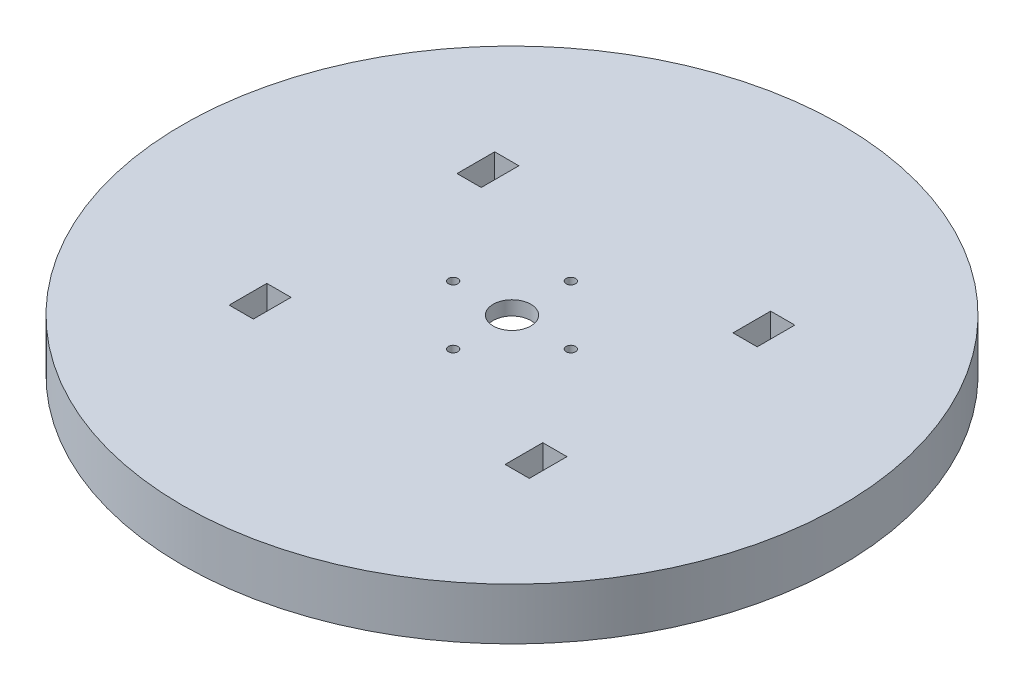
ISO-10303-21;
HEADER;
FILE_DESCRIPTION(('STEP AP214'),'2;1');
FILE_NAME('part.step','',(''),(''),'','','');
FILE_SCHEMA(('AUTOMOTIVE_DESIGN { 1 0 10303 214 1 1 1 1 }'));
ENDSEC;
DATA;
#1=APPLICATION_CONTEXT('core data for automotive mechanical design processes');
#2=APPLICATION_PROTOCOL_DEFINITION('international standard','automotive_design',2000,#1);
#3=PRODUCT_CONTEXT('',#1,'mechanical');
#4=PRODUCT('Part','Part','',(#3));
#5=PRODUCT_RELATED_PRODUCT_CATEGORY('part','',(#4));
#6=PRODUCT_DEFINITION_FORMATION('','',#4);
#7=PRODUCT_DEFINITION_CONTEXT('part definition',#1,'design');
#8=PRODUCT_DEFINITION('design','',#6,#7);
#9=PRODUCT_DEFINITION_SHAPE('','',#8);
#10=(LENGTH_UNIT() NAMED_UNIT(*) SI_UNIT(.MILLI.,.METRE.));
#11=(NAMED_UNIT(*) PLANE_ANGLE_UNIT() SI_UNIT($,.RADIAN.));
#12=(NAMED_UNIT(*) SI_UNIT($,.STERADIAN.) SOLID_ANGLE_UNIT());
#13=UNCERTAINTY_MEASURE_WITH_UNIT(LENGTH_MEASURE(1.E-05),#10,'distance_accuracy_value','');
#14=(GEOMETRIC_REPRESENTATION_CONTEXT(3) GLOBAL_UNCERTAINTY_ASSIGNED_CONTEXT((#13)) GLOBAL_UNIT_ASSIGNED_CONTEXT((#10,
#11,#12)) REPRESENTATION_CONTEXT('',''));
#15=CARTESIAN_POINT('',(0.,0.,0.));
#16=DIRECTION('',(0.,0.,1.));
#17=DIRECTION('',(1.,0.,0.));
#18=AXIS2_PLACEMENT_3D('',#15,#16,#17);
#19=CARTESIAN_POINT('',(12.5,-3.,0.));
#20=DIRECTION('',(0.,1.,0.));
#21=DIRECTION('',(0.,0.,1.));
#22=AXIS2_PLACEMENT_3D('',#19,#20,#21);
#23=CYLINDRICAL_SURFACE('',#22,1.);
#24=CARTESIAN_POINT('',(12.5,-3.,0.));
#25=DIRECTION('',(0.,1.,0.));
#26=DIRECTION('',(0.,0.,1.));
#27=AXIS2_PLACEMENT_3D('',#24,#25,#26);
#28=CIRCLE('',#27,1.);
#29=CARTESIAN_POINT('',(12.5,-3.,1.));
#30=VERTEX_POINT('',#29);
#31=EDGE_CURVE('E47',#30,#30,#28,.T.);
#32=ORIENTED_EDGE('',*,*,#31,.F.);
#33=EDGE_LOOP('',(#32));
#34=FACE_BOUND('',#33,.T.);
#35=CARTESIAN_POINT('',(12.5,0.,0.));
#36=DIRECTION('',(0.,1.,0.));
#37=DIRECTION('',(0.,0.,1.));
#38=AXIS2_PLACEMENT_3D('',#35,#36,#37);
#39=CIRCLE('',#38,1.);
#40=CARTESIAN_POINT('',(12.5,0.,1.));
#41=VERTEX_POINT('',#40);
#42=EDGE_CURVE('E283',#41,#41,#39,.T.);
#43=ORIENTED_EDGE('',*,*,#42,.T.);
#44=EDGE_LOOP('',(#43));
#45=FACE_BOUND('',#44,.T.);
#46=ADVANCED_FACE('F37',(#34,#45),#23,.F.);
#47=CARTESIAN_POINT('',(0.,-3.,-12.5));
#48=DIRECTION('',(0.,1.,0.));
#49=DIRECTION('',(0.,0.,1.));
#50=AXIS2_PLACEMENT_3D('',#47,#48,#49);
#51=CYLINDRICAL_SURFACE('',#50,1.);
#52=CARTESIAN_POINT('',(0.,-3.,-12.5));
#53=DIRECTION('',(0.,1.,0.));
#54=DIRECTION('',(0.,0.,1.));
#55=AXIS2_PLACEMENT_3D('',#52,#53,#54);
#56=CIRCLE('',#55,1.);
#57=CARTESIAN_POINT('',(0.,-3.,-11.5));
#58=VERTEX_POINT('',#57);
#59=EDGE_CURVE('E268',#58,#58,#56,.T.);
#60=ORIENTED_EDGE('',*,*,#59,.F.);
#61=EDGE_LOOP('',(#60));
#62=FACE_BOUND('',#61,.T.);
#63=CARTESIAN_POINT('',(0.,0.,-12.5));
#64=DIRECTION('',(0.,1.,0.));
#65=DIRECTION('',(0.,0.,1.));
#66=AXIS2_PLACEMENT_3D('',#63,#64,#65);
#67=CIRCLE('',#66,1.);
#68=CARTESIAN_POINT('',(0.,0.,-11.5));
#69=VERTEX_POINT('',#68);
#70=EDGE_CURVE('E281',#69,#69,#67,.T.);
#71=ORIENTED_EDGE('',*,*,#70,.T.);
#72=EDGE_LOOP('',(#71));
#73=FACE_BOUND('',#72,.T.);
#74=ADVANCED_FACE('F309',(#62,#73),#51,.F.);
#75=CARTESIAN_POINT('',(0.,-3.,12.5));
#76=DIRECTION('',(0.,1.,0.));
#77=DIRECTION('',(0.,0.,1.));
#78=AXIS2_PLACEMENT_3D('',#75,#76,#77);
#79=CYLINDRICAL_SURFACE('',#78,1.);
#80=CARTESIAN_POINT('',(0.,-3.,12.5));
#81=DIRECTION('',(0.,1.,0.));
#82=DIRECTION('',(0.,0.,1.));
#83=AXIS2_PLACEMENT_3D('',#80,#81,#82);
#84=CIRCLE('',#83,1.);
#85=CARTESIAN_POINT('',(0.,-3.,13.5));
#86=VERTEX_POINT('',#85);
#87=EDGE_CURVE('E265',#86,#86,#84,.F.);
#88=ORIENTED_EDGE('',*,*,#87,.T.);
#89=EDGE_LOOP('',(#88));
#90=FACE_BOUND('',#89,.T.);
#91=CARTESIAN_POINT('',(0.,0.,12.5));
#92=DIRECTION('',(0.,1.,0.));
#93=DIRECTION('',(0.,0.,1.));
#94=AXIS2_PLACEMENT_3D('',#91,#92,#93);
#95=CIRCLE('',#94,1.);
#96=CARTESIAN_POINT('',(0.,0.,13.5));
#97=VERTEX_POINT('',#96);
#98=EDGE_CURVE('E278',#97,#97,#95,.F.);
#99=ORIENTED_EDGE('',*,*,#98,.F.);
#100=EDGE_LOOP('',(#99));
#101=FACE_BOUND('',#100,.T.);
#102=ADVANCED_FACE('F304',(#90,#101),#79,.F.);
#103=CARTESIAN_POINT('',(0.,-3.,0.));
#104=DIRECTION('',(0.,1.,0.));
#105=DIRECTION('',(0.,0.,1.));
#106=AXIS2_PLACEMENT_3D('',#103,#104,#105);
#107=CYLINDRICAL_SURFACE('',#106,4.);
#108=CARTESIAN_POINT('',(0.,-3.,0.));
#109=DIRECTION('',(0.,1.,0.));
#110=DIRECTION('',(0.,0.,1.));
#111=AXIS2_PLACEMENT_3D('',#108,#109,#110);
#112=CIRCLE('',#111,4.);
#113=CARTESIAN_POINT('',(0.,-3.,4.));
#114=VERTEX_POINT('',#113);
#115=EDGE_CURVE('E262',#114,#114,#112,.T.);
#116=ORIENTED_EDGE('',*,*,#115,.F.);
#117=EDGE_LOOP('',(#116));
#118=FACE_BOUND('',#117,.T.);
#119=CARTESIAN_POINT('',(0.,0.,0.));
#120=DIRECTION('',(0.,1.,0.));
#121=DIRECTION('',(0.,0.,1.));
#122=AXIS2_PLACEMENT_3D('',#119,#120,#121);
#123=CIRCLE('',#122,4.);
#124=CARTESIAN_POINT('',(0.,0.,4.));
#125=VERTEX_POINT('',#124);
#126=EDGE_CURVE('E233',#125,#125,#123,.T.);
#127=ORIENTED_EDGE('',*,*,#126,.T.);
#128=EDGE_LOOP('',(#127));
#129=FACE_BOUND('',#128,.T.);
#130=ADVANCED_FACE('F39',(#118,#129),#107,.F.);
#131=CARTESIAN_POINT('',(-12.5,-3.,0.));
#132=DIRECTION('',(0.,1.,0.));
#133=DIRECTION('',(0.,0.,1.));
#134=AXIS2_PLACEMENT_3D('',#131,#132,#133);
#135=CYLINDRICAL_SURFACE('',#134,1.);
#136=CARTESIAN_POINT('',(-12.5,-3.,0.));
#137=DIRECTION('',(0.,1.,0.));
#138=DIRECTION('',(0.,0.,1.));
#139=AXIS2_PLACEMENT_3D('',#136,#137,#138);
#140=CIRCLE('',#139,1.);
#141=CARTESIAN_POINT('',(-12.5,-3.,1.));
#142=VERTEX_POINT('',#141);
#143=EDGE_CURVE('E11',#142,#142,#140,.F.);
#144=ORIENTED_EDGE('',*,*,#143,.T.);
#145=EDGE_LOOP('',(#144));
#146=FACE_BOUND('',#145,.T.);
#147=CARTESIAN_POINT('',(-12.5,0.,0.));
#148=DIRECTION('',(0.,1.,0.));
#149=DIRECTION('',(0.,0.,1.));
#150=AXIS2_PLACEMENT_3D('',#147,#148,#149);
#151=CIRCLE('',#150,1.);
#152=CARTESIAN_POINT('',(-12.5,0.,1.));
#153=VERTEX_POINT('',#152);
#154=EDGE_CURVE('E41',#153,#153,#151,.F.);
#155=ORIENTED_EDGE('',*,*,#154,.F.);
#156=EDGE_LOOP('',(#155));
#157=FACE_BOUND('',#156,.T.);
#158=ADVANCED_FACE('F293',(#146,#157),#135,.F.);
#159=CARTESIAN_POINT('',(0.,-3.,0.));
#160=DIRECTION('',(0.,1.,0.));
#161=DIRECTION('',(0.,0.,1.));
#162=AXIS2_PLACEMENT_3D('',#159,#160,#161);
#163=PLANE('',#162);
#164=ORIENTED_EDGE('',*,*,#115,.T.);
#165=EDGE_LOOP('',(#164));
#166=FACE_BOUND('',#165,.T.);
#167=ORIENTED_EDGE('',*,*,#87,.F.);
#168=EDGE_LOOP('',(#167));
#169=FACE_BOUND('',#168,.T.);
#170=ORIENTED_EDGE('',*,*,#59,.T.);
#171=EDGE_LOOP('',(#170));
#172=FACE_BOUND('',#171,.T.);
#173=CARTESIAN_POINT('',(0.,-3.,0.));
#174=DIRECTION('',(0.,1.,0.));
#175=DIRECTION('',(0.,0.,1.));
#176=AXIS2_PLACEMENT_3D('',#173,#174,#175);
#177=CIRCLE('',#176,22.5);
#178=CARTESIAN_POINT('',(0.,-3.,22.5));
#179=VERTEX_POINT('',#178);
#180=EDGE_CURVE('E271',#179,#179,#177,.T.);
#181=ORIENTED_EDGE('',*,*,#180,.F.);
#182=EDGE_LOOP('',(#181));
#183=FACE_BOUND('',#182,.T.);
#184=ORIENTED_EDGE('',*,*,#31,.T.);
#185=EDGE_LOOP('',(#184));
#186=FACE_BOUND('',#185,.T.);
#187=ORIENTED_EDGE('',*,*,#143,.F.);
#188=EDGE_LOOP('',(#187));
#189=FACE_BOUND('',#188,.T.);
#190=ADVANCED_FACE('F295',(#166,#169,#172,#183,#186,#189),#163,.F.);
#191=CARTESIAN_POINT('',(0.,0.,0.));
#192=DIRECTION('',(0.,1.,0.));
#193=DIRECTION('',(0.,0.,1.));
#194=AXIS2_PLACEMENT_3D('',#191,#192,#193);
#195=PLANE('',#194);
#196=ORIENTED_EDGE('',*,*,#126,.F.);
#197=EDGE_LOOP('',(#196));
#198=FACE_BOUND('',#197,.T.);
#199=ORIENTED_EDGE('',*,*,#98,.T.);
#200=EDGE_LOOP('',(#199));
#201=FACE_BOUND('',#200,.T.);
#202=ORIENTED_EDGE('',*,*,#70,.F.);
#203=EDGE_LOOP('',(#202));
#204=FACE_BOUND('',#203,.T.);
#205=ORIENTED_EDGE('',*,*,#42,.F.);
#206=EDGE_LOOP('',(#205));
#207=FACE_BOUND('',#206,.T.);
#208=ORIENTED_EDGE('',*,*,#154,.T.);
#209=EDGE_LOOP('',(#208));
#210=FACE_BOUND('',#209,.T.);
#211=DIRECTION('',(1.,0.,0.));
#212=VECTOR('',#211,1.);
#213=CARTESIAN_POINT('',(0.,0.,-20.2));
#214=LINE('',#213,#212);
#215=CARTESIAN_POINT('',(26.7380641973512,0.,-20.2));
#216=VERTEX_POINT('',#215);
#217=CARTESIAN_POINT('',(31.8763716720232,0.,-20.2));
#218=VERTEX_POINT('',#217);
#219=EDGE_CURVE('E186',#216,#218,#214,.T.);
#220=ORIENTED_EDGE('',*,*,#219,.F.);
#221=DIRECTION('',(0.,0.,-1.));
#222=VECTOR('',#221,1.);
#223=CARTESIAN_POINT('',(26.7380641973512,0.,0.));
#224=LINE('',#223,#222);
#225=CARTESIAN_POINT('',(26.7380641973512,0.,-28.2));
#226=VERTEX_POINT('',#225);
#227=EDGE_CURVE('E189',#216,#226,#224,.T.);
#228=ORIENTED_EDGE('',*,*,#227,.T.);
#229=DIRECTION('',(1.,0.,0.));
#230=VECTOR('',#229,1.);
#231=CARTESIAN_POINT('',(0.,0.,-28.2));
#232=LINE('',#231,#230);
#233=CARTESIAN_POINT('',(31.8763716720232,0.,-28.2));
#234=VERTEX_POINT('',#233);
#235=EDGE_CURVE('E193',#226,#234,#232,.T.);
#236=ORIENTED_EDGE('',*,*,#235,.T.);
#237=DIRECTION('',(0.,0.,-1.));
#238=VECTOR('',#237,1.);
#239=CARTESIAN_POINT('',(31.8763716720232,0.,0.));
#240=LINE('',#239,#238);
#241=EDGE_CURVE('E196',#218,#234,#240,.T.);
#242=ORIENTED_EDGE('',*,*,#241,.F.);
#243=EDGE_LOOP('',(#220,#228,#236,#242));
#244=FACE_BOUND('',#243,.T.);
#245=DIRECTION('',(-1.,0.,0.));
#246=VECTOR('',#245,1.);
#247=CARTESIAN_POINT('',(0.,0.,20.2));
#248=LINE('',#247,#246);
#249=CARTESIAN_POINT('',(-26.7380641973512,0.,20.2));
#250=VERTEX_POINT('',#249);
#251=CARTESIAN_POINT('',(-31.8763716720232,0.,20.2));
#252=VERTEX_POINT('',#251);
#253=EDGE_CURVE('E199',#250,#252,#248,.T.);
#254=ORIENTED_EDGE('',*,*,#253,.F.);
#255=DIRECTION('',(0.,0.,1.));
#256=VECTOR('',#255,1.);
#257=CARTESIAN_POINT('',(-26.7380641973512,0.,0.));
#258=LINE('',#257,#256);
#259=CARTESIAN_POINT('',(-26.7380641973512,0.,28.2));
#260=VERTEX_POINT('',#259);
#261=EDGE_CURVE('E202',#250,#260,#258,.T.);
#262=ORIENTED_EDGE('',*,*,#261,.T.);
#263=DIRECTION('',(-1.,0.,0.));
#264=VECTOR('',#263,1.);
#265=CARTESIAN_POINT('',(0.,0.,28.2));
#266=LINE('',#265,#264);
#267=CARTESIAN_POINT('',(-31.8763716720232,0.,28.2));
#268=VERTEX_POINT('',#267);
#269=EDGE_CURVE('E205',#260,#268,#266,.T.);
#270=ORIENTED_EDGE('',*,*,#269,.T.);
#271=DIRECTION('',(0.,0.,1.));
#272=VECTOR('',#271,1.);
#273=CARTESIAN_POINT('',(-31.8763716720232,0.,0.));
#274=LINE('',#273,#272);
#275=EDGE_CURVE('E208',#252,#268,#274,.T.);
#276=ORIENTED_EDGE('',*,*,#275,.F.);
#277=EDGE_LOOP('',(#254,#262,#270,#276));
#278=FACE_BOUND('',#277,.T.);
#279=DIRECTION('',(-1.,0.,0.));
#280=VECTOR('',#279,1.);
#281=CARTESIAN_POINT('',(0.,0.,-20.2));
#282=LINE('',#281,#280);
#283=CARTESIAN_POINT('',(-26.7380641973512,0.,-20.2));
#284=VERTEX_POINT('',#283);
#285=CARTESIAN_POINT('',(-31.8763716720232,0.,-20.2));
#286=VERTEX_POINT('',#285);
#287=EDGE_CURVE('E211',#284,#286,#282,.T.);
#288=ORIENTED_EDGE('',*,*,#287,.T.);
#289=DIRECTION('',(0.,0.,-1.));
#290=VECTOR('',#289,1.);
#291=CARTESIAN_POINT('',(-31.8763716720232,0.,0.));
#292=LINE('',#291,#290);
#293=CARTESIAN_POINT('',(-31.8763716720232,0.,-28.2));
#294=VERTEX_POINT('',#293);
#295=EDGE_CURVE('E214',#286,#294,#292,.T.);
#296=ORIENTED_EDGE('',*,*,#295,.T.);
#297=DIRECTION('',(-1.,0.,0.));
#298=VECTOR('',#297,1.);
#299=CARTESIAN_POINT('',(0.,0.,-28.2));
#300=LINE('',#299,#298);
#301=CARTESIAN_POINT('',(-26.7380641973512,0.,-28.2));
#302=VERTEX_POINT('',#301);
#303=EDGE_CURVE('E217',#302,#294,#300,.T.);
#304=ORIENTED_EDGE('',*,*,#303,.F.);
#305=DIRECTION('',(0.,0.,-1.));
#306=VECTOR('',#305,1.);
#307=CARTESIAN_POINT('',(-26.7380641973512,0.,0.));
#308=LINE('',#307,#306);
#309=EDGE_CURVE('E220',#284,#302,#308,.T.);
#310=ORIENTED_EDGE('',*,*,#309,.F.);
#311=EDGE_LOOP('',(#288,#296,#304,#310));
#312=FACE_BOUND('',#311,.T.);
#313=DIRECTION('',(1.,0.,0.));
#314=VECTOR('',#313,1.);
#315=CARTESIAN_POINT('',(0.,0.,28.2));
#316=LINE('',#315,#314);
#317=CARTESIAN_POINT('',(26.7380641973512,0.,28.2));
#318=VERTEX_POINT('',#317);
#319=CARTESIAN_POINT('',(31.8763716720232,0.,28.2));
#320=VERTEX_POINT('',#319);
#321=EDGE_CURVE('E223',#318,#320,#316,.T.);
#322=ORIENTED_EDGE('',*,*,#321,.F.);
#323=DIRECTION('',(0.,0.,1.));
#324=VECTOR('',#323,1.);
#325=CARTESIAN_POINT('',(26.7380641973512,0.,0.));
#326=LINE('',#325,#324);
#327=CARTESIAN_POINT('',(26.7380641973512,0.,20.2));
#328=VERTEX_POINT('',#327);
#329=EDGE_CURVE('E225',#328,#318,#326,.T.);
#330=ORIENTED_EDGE('',*,*,#329,.F.);
#331=DIRECTION('',(1.,0.,0.));
#332=VECTOR('',#331,1.);
#333=CARTESIAN_POINT('',(0.,0.,20.2));
#334=LINE('',#333,#332);
#335=CARTESIAN_POINT('',(31.8763716720232,0.,20.2));
#336=VERTEX_POINT('',#335);
#337=EDGE_CURVE('E166',#328,#336,#334,.T.);
#338=ORIENTED_EDGE('',*,*,#337,.T.);
#339=DIRECTION('',(0.,0.,1.));
#340=VECTOR('',#339,1.);
#341=CARTESIAN_POINT('',(31.8763716720232,0.,0.));
#342=LINE('',#341,#340);
#343=EDGE_CURVE('E228',#336,#320,#342,.T.);
#344=ORIENTED_EDGE('',*,*,#343,.T.);
#345=EDGE_LOOP('',(#322,#330,#338,#344));
#346=FACE_BOUND('',#345,.T.);
#347=CARTESIAN_POINT('',(0.,0.,0.));
#348=DIRECTION('',(0.,1.,0.));
#349=DIRECTION('',(0.,0.,1.));
#350=AXIS2_PLACEMENT_3D('',#347,#348,#349);
#351=CIRCLE('',#350,70.);
#352=CARTESIAN_POINT('',(0.,0.,70.));
#353=VERTEX_POINT('',#352);
#354=EDGE_CURVE('E420',#353,#353,#351,.T.);
#355=ORIENTED_EDGE('',*,*,#354,.T.);
#356=EDGE_LOOP('',(#355));
#357=FACE_BOUND('',#356,.T.);
#358=ADVANCED_FACE('F290',(#198,#201,#204,#207,#210,#244,#278,#312,#346,#357),#195,.T.);
#359=CARTESIAN_POINT('',(0.,-8.,0.));
#360=DIRECTION('',(0.,1.,0.));
#361=DIRECTION('',(0.,0.,1.));
#362=AXIS2_PLACEMENT_3D('',#359,#360,#361);
#363=CYLINDRICAL_SURFACE('',#362,22.5);
#364=CARTESIAN_POINT('',(0.,-8.,0.));
#365=DIRECTION('',(0.,1.,0.));
#366=DIRECTION('',(0.,0.,1.));
#367=AXIS2_PLACEMENT_3D('',#364,#365,#366);
#368=CIRCLE('',#367,22.5);
#369=CARTESIAN_POINT('',(0.,-8.,22.5));
#370=VERTEX_POINT('',#369);
#371=EDGE_CURVE('E231',#370,#370,#368,.T.);
#372=ORIENTED_EDGE('',*,*,#371,.F.);
#373=EDGE_LOOP('',(#372));
#374=FACE_BOUND('',#373,.T.);
#375=ORIENTED_EDGE('',*,*,#180,.T.);
#376=EDGE_LOOP('',(#375));
#377=FACE_BOUND('',#376,.T.);
#378=ADVANCED_FACE('F327',(#374,#377),#363,.F.);
#379=CARTESIAN_POINT('',(0.,-8.,28.2));
#380=DIRECTION('',(0.,0.,1.));
#381=DIRECTION('',(1.,0.,0.));
#382=AXIS2_PLACEMENT_3D('',#379,#380,#381);
#383=PLANE('',#382);
#384=ORIENTED_EDGE('',*,*,#321,.T.);
#385=DIRECTION('',(0.,1.,0.));
#386=VECTOR('',#385,1.);
#387=CARTESIAN_POINT('',(31.8763716720232,-8.,28.2));
#388=LINE('',#387,#386);
#389=CARTESIAN_POINT('',(31.8763716720232,-8.,28.2));
#390=VERTEX_POINT('',#389);
#391=EDGE_CURVE('E116',#390,#320,#388,.T.);
#392=ORIENTED_EDGE('',*,*,#391,.F.);
#393=DIRECTION('',(1.,0.,0.));
#394=VECTOR('',#393,1.);
#395=CARTESIAN_POINT('',(0.,-8.,28.2));
#396=LINE('',#395,#394);
#397=CARTESIAN_POINT('',(26.7380641973512,-8.,28.2));
#398=VERTEX_POINT('',#397);
#399=EDGE_CURVE('E56',#398,#390,#396,.T.);
#400=ORIENTED_EDGE('',*,*,#399,.F.);
#401=DIRECTION('',(0.,1.,0.));
#402=VECTOR('',#401,1.);
#403=CARTESIAN_POINT('',(26.7380641973512,-8.,28.2));
#404=LINE('',#403,#402);
#405=EDGE_CURVE('E169',#398,#318,#404,.T.);
#406=ORIENTED_EDGE('',*,*,#405,.T.);
#407=EDGE_LOOP('',(#384,#392,#400,#406));
#408=FACE_BOUND('',#407,.T.);
#409=ADVANCED_FACE('F335',(#408),#383,.F.);
#410=CARTESIAN_POINT('',(31.8763716720232,-8.,0.));
#411=DIRECTION('',(-1.,0.,0.));
#412=DIRECTION('',(0.,0.,1.));
#413=AXIS2_PLACEMENT_3D('',#410,#411,#412);
#414=PLANE('',#413);
#415=ORIENTED_EDGE('',*,*,#343,.F.);
#416=DIRECTION('',(0.,1.,0.));
#417=VECTOR('',#416,1.);
#418=CARTESIAN_POINT('',(31.8763716720232,-8.,20.2));
#419=LINE('',#418,#417);
#420=CARTESIAN_POINT('',(31.8763716720232,-8.,20.2));
#421=VERTEX_POINT('',#420);
#422=EDGE_CURVE('E109',#421,#336,#419,.T.);
#423=ORIENTED_EDGE('',*,*,#422,.F.);
#424=DIRECTION('',(0.,0.,1.));
#425=VECTOR('',#424,1.);
#426=CARTESIAN_POINT('',(31.8763716720232,-8.,0.));
#427=LINE('',#426,#425);
#428=EDGE_CURVE('E178',#421,#390,#427,.T.);
#429=ORIENTED_EDGE('',*,*,#428,.T.);
#430=ORIENTED_EDGE('',*,*,#391,.T.);
#431=EDGE_LOOP('',(#415,#423,#429,#430));
#432=FACE_BOUND('',#431,.T.);
#433=ADVANCED_FACE('F389',(#432),#414,.T.);
#434=CARTESIAN_POINT('',(0.,-8.,20.2));
#435=DIRECTION('',(0.,0.,1.));
#436=DIRECTION('',(1.,0.,0.));
#437=AXIS2_PLACEMENT_3D('',#434,#435,#436);
#438=PLANE('',#437);
#439=ORIENTED_EDGE('',*,*,#337,.F.);
#440=DIRECTION('',(0.,1.,0.));
#441=VECTOR('',#440,1.);
#442=CARTESIAN_POINT('',(26.7380641973512,-8.,20.2));
#443=LINE('',#442,#441);
#444=CARTESIAN_POINT('',(26.7380641973512,-8.,20.2));
#445=VERTEX_POINT('',#444);
#446=EDGE_CURVE('E161',#445,#328,#443,.T.);
#447=ORIENTED_EDGE('',*,*,#446,.F.);
#448=DIRECTION('',(1.,0.,0.));
#449=VECTOR('',#448,1.);
#450=CARTESIAN_POINT('',(0.,-8.,20.2));
#451=LINE('',#450,#449);
#452=EDGE_CURVE('E165',#445,#421,#451,.T.);
#453=ORIENTED_EDGE('',*,*,#452,.T.);
#454=ORIENTED_EDGE('',*,*,#422,.T.);
#455=EDGE_LOOP('',(#439,#447,#453,#454));
#456=FACE_BOUND('',#455,.T.);
#457=ADVANCED_FACE('F163',(#456),#438,.T.);
#458=CARTESIAN_POINT('',(0.,-8.,-20.2));
#459=DIRECTION('',(0.,0.,-1.));
#460=DIRECTION('',(-1.,0.,0.));
#461=AXIS2_PLACEMENT_3D('',#458,#459,#460);
#462=PLANE('',#461);
#463=ORIENTED_EDGE('',*,*,#287,.F.);
#464=DIRECTION('',(0.,1.,0.));
#465=VECTOR('',#464,1.);
#466=CARTESIAN_POINT('',(-26.7380641973512,-8.,-20.2));
#467=LINE('',#466,#465);
#468=CARTESIAN_POINT('',(-26.7380641973512,-8.,-20.2));
#469=VERTEX_POINT('',#468);
#470=EDGE_CURVE('E236',#469,#284,#467,.T.);
#471=ORIENTED_EDGE('',*,*,#470,.F.);
#472=DIRECTION('',(-1.,0.,0.));
#473=VECTOR('',#472,1.);
#474=CARTESIAN_POINT('',(0.,-8.,-20.2));
#475=LINE('',#474,#473);
#476=CARTESIAN_POINT('',(-31.8763716720232,-8.,-20.2));
#477=VERTEX_POINT('',#476);
#478=EDGE_CURVE('E448',#469,#477,#475,.T.);
#479=ORIENTED_EDGE('',*,*,#478,.T.);
#480=DIRECTION('',(0.,1.,0.));
#481=VECTOR('',#480,1.);
#482=CARTESIAN_POINT('',(-31.8763716720232,-8.,-20.2));
#483=LINE('',#482,#481);
#484=EDGE_CURVE('E243',#477,#286,#483,.T.);
#485=ORIENTED_EDGE('',*,*,#484,.T.);
#486=EDGE_LOOP('',(#463,#471,#479,#485));
#487=FACE_BOUND('',#486,.T.);
#488=ADVANCED_FACE('F373',(#487),#462,.T.);
#489=CARTESIAN_POINT('',(-26.7380641973512,-8.,0.));
#490=DIRECTION('',(1.,0.,0.));
#491=DIRECTION('',(0.,0.,-1.));
#492=AXIS2_PLACEMENT_3D('',#489,#490,#491);
#493=PLANE('',#492);
#494=ORIENTED_EDGE('',*,*,#309,.T.);
#495=DIRECTION('',(0.,1.,0.));
#496=VECTOR('',#495,1.);
#497=CARTESIAN_POINT('',(-26.7380641973512,-8.,-28.2));
#498=LINE('',#497,#496);
#499=CARTESIAN_POINT('',(-26.7380641973512,-8.,-28.2));
#500=VERTEX_POINT('',#499);
#501=EDGE_CURVE('E238',#500,#302,#498,.T.);
#502=ORIENTED_EDGE('',*,*,#501,.F.);
#503=DIRECTION('',(0.,0.,-1.));
#504=VECTOR('',#503,1.);
#505=CARTESIAN_POINT('',(-26.7380641973512,-8.,0.));
#506=LINE('',#505,#504);
#507=EDGE_CURVE('E456',#469,#500,#506,.T.);
#508=ORIENTED_EDGE('',*,*,#507,.F.);
#509=ORIENTED_EDGE('',*,*,#470,.T.);
#510=EDGE_LOOP('',(#494,#502,#508,#509));
#511=FACE_BOUND('',#510,.T.);
#512=ADVANCED_FACE('F376',(#511),#493,.F.);
#513=CARTESIAN_POINT('',(0.,-8.,-28.2));
#514=DIRECTION('',(0.,0.,-1.));
#515=DIRECTION('',(-1.,0.,0.));
#516=AXIS2_PLACEMENT_3D('',#513,#514,#515);
#517=PLANE('',#516);
#518=ORIENTED_EDGE('',*,*,#303,.T.);
#519=DIRECTION('',(0.,1.,0.));
#520=VECTOR('',#519,1.);
#521=CARTESIAN_POINT('',(-31.8763716720232,-8.,-28.2));
#522=LINE('',#521,#520);
#523=CARTESIAN_POINT('',(-31.8763716720232,-8.,-28.2));
#524=VERTEX_POINT('',#523);
#525=EDGE_CURVE('E241',#524,#294,#522,.T.);
#526=ORIENTED_EDGE('',*,*,#525,.F.);
#527=DIRECTION('',(-1.,0.,0.));
#528=VECTOR('',#527,1.);
#529=CARTESIAN_POINT('',(0.,-8.,-28.2));
#530=LINE('',#529,#528);
#531=EDGE_CURVE('E454',#500,#524,#530,.T.);
#532=ORIENTED_EDGE('',*,*,#531,.F.);
#533=ORIENTED_EDGE('',*,*,#501,.T.);
#534=EDGE_LOOP('',(#518,#526,#532,#533));
#535=FACE_BOUND('',#534,.T.);
#536=ADVANCED_FACE('F361',(#535),#517,.F.);
#537=CARTESIAN_POINT('',(0.,-8.,20.2));
#538=DIRECTION('',(0.,0.,-1.));
#539=DIRECTION('',(-1.,0.,0.));
#540=AXIS2_PLACEMENT_3D('',#537,#538,#539);
#541=PLANE('',#540);
#542=ORIENTED_EDGE('',*,*,#253,.T.);
#543=DIRECTION('',(0.,1.,0.));
#544=VECTOR('',#543,1.);
#545=CARTESIAN_POINT('',(-31.8763716720232,-8.,20.2));
#546=LINE('',#545,#544);
#547=CARTESIAN_POINT('',(-31.8763716720232,-8.,20.2));
#548=VERTEX_POINT('',#547);
#549=EDGE_CURVE('E245',#548,#252,#546,.T.);
#550=ORIENTED_EDGE('',*,*,#549,.F.);
#551=DIRECTION('',(-1.,0.,0.));
#552=VECTOR('',#551,1.);
#553=CARTESIAN_POINT('',(0.,-8.,20.2));
#554=LINE('',#553,#552);
#555=CARTESIAN_POINT('',(-26.7380641973512,-8.,20.2));
#556=VERTEX_POINT('',#555);
#557=EDGE_CURVE('E437',#556,#548,#554,.T.);
#558=ORIENTED_EDGE('',*,*,#557,.F.);
#559=DIRECTION('',(0.,1.,0.));
#560=VECTOR('',#559,1.);
#561=CARTESIAN_POINT('',(-26.7380641973512,-8.,20.2));
#562=LINE('',#561,#560);
#563=EDGE_CURVE('E252',#556,#250,#562,.T.);
#564=ORIENTED_EDGE('',*,*,#563,.T.);
#565=EDGE_LOOP('',(#542,#550,#558,#564));
#566=FACE_BOUND('',#565,.T.);
#567=ADVANCED_FACE('F357',(#566),#541,.F.);
#568=CARTESIAN_POINT('',(-31.8763716720232,-8.,0.));
#569=DIRECTION('',(-1.,0.,0.));
#570=DIRECTION('',(0.,0.,1.));
#571=AXIS2_PLACEMENT_3D('',#568,#569,#570);
#572=PLANE('',#571);
#573=ORIENTED_EDGE('',*,*,#275,.T.);
#574=DIRECTION('',(0.,1.,0.));
#575=VECTOR('',#574,1.);
#576=CARTESIAN_POINT('',(-31.8763716720232,-8.,28.2));
#577=LINE('',#576,#575);
#578=CARTESIAN_POINT('',(-31.8763716720232,-8.,28.2));
#579=VERTEX_POINT('',#578);
#580=EDGE_CURVE('E248',#579,#268,#577,.T.);
#581=ORIENTED_EDGE('',*,*,#580,.F.);
#582=DIRECTION('',(0.,0.,1.));
#583=VECTOR('',#582,1.);
#584=CARTESIAN_POINT('',(-31.8763716720232,-8.,0.));
#585=LINE('',#584,#583);
#586=EDGE_CURVE('E446',#548,#579,#585,.T.);
#587=ORIENTED_EDGE('',*,*,#586,.F.);
#588=ORIENTED_EDGE('',*,*,#549,.T.);
#589=EDGE_LOOP('',(#573,#581,#587,#588));
#590=FACE_BOUND('',#589,.T.);
#591=ADVANCED_FACE('F360',(#590),#572,.F.);
#592=CARTESIAN_POINT('',(0.,-8.,28.2));
#593=DIRECTION('',(0.,0.,-1.));
#594=DIRECTION('',(-1.,0.,0.));
#595=AXIS2_PLACEMENT_3D('',#592,#593,#594);
#596=PLANE('',#595);
#597=ORIENTED_EDGE('',*,*,#269,.F.);
#598=DIRECTION('',(0.,1.,0.));
#599=VECTOR('',#598,1.);
#600=CARTESIAN_POINT('',(-26.7380641973512,-8.,28.2));
#601=LINE('',#600,#599);
#602=CARTESIAN_POINT('',(-26.7380641973512,-8.,28.2));
#603=VERTEX_POINT('',#602);
#604=EDGE_CURVE('E250',#603,#260,#601,.T.);
#605=ORIENTED_EDGE('',*,*,#604,.F.);
#606=DIRECTION('',(-1.,0.,0.));
#607=VECTOR('',#606,1.);
#608=CARTESIAN_POINT('',(0.,-8.,28.2));
#609=LINE('',#608,#607);
#610=EDGE_CURVE('E443',#603,#579,#609,.T.);
#611=ORIENTED_EDGE('',*,*,#610,.T.);
#612=ORIENTED_EDGE('',*,*,#580,.T.);
#613=EDGE_LOOP('',(#597,#605,#611,#612));
#614=FACE_BOUND('',#613,.T.);
#615=ADVANCED_FACE('F344',(#614),#596,.T.);
#616=CARTESIAN_POINT('',(0.,-8.,-20.2));
#617=DIRECTION('',(0.,0.,1.));
#618=DIRECTION('',(1.,0.,0.));
#619=AXIS2_PLACEMENT_3D('',#616,#617,#618);
#620=PLANE('',#619);
#621=ORIENTED_EDGE('',*,*,#219,.T.);
#622=DIRECTION('',(0.,1.,0.));
#623=VECTOR('',#622,1.);
#624=CARTESIAN_POINT('',(31.8763716720232,-8.,-20.2));
#625=LINE('',#624,#623);
#626=CARTESIAN_POINT('',(31.8763716720232,-8.,-20.2));
#627=VERTEX_POINT('',#626);
#628=EDGE_CURVE('E254',#627,#218,#625,.T.);
#629=ORIENTED_EDGE('',*,*,#628,.F.);
#630=DIRECTION('',(1.,0.,0.));
#631=VECTOR('',#630,1.);
#632=CARTESIAN_POINT('',(0.,-8.,-20.2));
#633=LINE('',#632,#631);
#634=CARTESIAN_POINT('',(26.7380641973512,-8.,-20.2));
#635=VERTEX_POINT('',#634);
#636=EDGE_CURVE('E427',#635,#627,#633,.T.);
#637=ORIENTED_EDGE('',*,*,#636,.F.);
#638=DIRECTION('',(0.,1.,0.));
#639=VECTOR('',#638,1.);
#640=CARTESIAN_POINT('',(26.7380641973512,-8.,-20.2));
#641=LINE('',#640,#639);
#642=EDGE_CURVE('E124',#635,#216,#641,.T.);
#643=ORIENTED_EDGE('',*,*,#642,.T.);
#644=EDGE_LOOP('',(#621,#629,#637,#643));
#645=FACE_BOUND('',#644,.T.);
#646=ADVANCED_FACE('F340',(#645),#620,.F.);
#647=CARTESIAN_POINT('',(31.8763716720232,-8.,0.));
#648=DIRECTION('',(1.,0.,0.));
#649=DIRECTION('',(0.,0.,-1.));
#650=AXIS2_PLACEMENT_3D('',#647,#648,#649);
#651=PLANE('',#650);
#652=ORIENTED_EDGE('',*,*,#241,.T.);
#653=DIRECTION('',(0.,1.,0.));
#654=VECTOR('',#653,1.);
#655=CARTESIAN_POINT('',(31.8763716720232,-8.,-28.2));
#656=LINE('',#655,#654);
#657=CARTESIAN_POINT('',(31.8763716720232,-8.,-28.2));
#658=VERTEX_POINT('',#657);
#659=EDGE_CURVE('E257',#658,#234,#656,.T.);
#660=ORIENTED_EDGE('',*,*,#659,.F.);
#661=DIRECTION('',(0.,0.,-1.));
#662=VECTOR('',#661,1.);
#663=CARTESIAN_POINT('',(31.8763716720232,-8.,0.));
#664=LINE('',#663,#662);
#665=EDGE_CURVE('E435',#627,#658,#664,.T.);
#666=ORIENTED_EDGE('',*,*,#665,.F.);
#667=ORIENTED_EDGE('',*,*,#628,.T.);
#668=EDGE_LOOP('',(#652,#660,#666,#667));
#669=FACE_BOUND('',#668,.T.);
#670=ADVANCED_FACE('F343',(#669),#651,.F.);
#671=CARTESIAN_POINT('',(0.,-8.,-28.2));
#672=DIRECTION('',(0.,0.,1.));
#673=DIRECTION('',(1.,0.,0.));
#674=AXIS2_PLACEMENT_3D('',#671,#672,#673);
#675=PLANE('',#674);
#676=ORIENTED_EDGE('',*,*,#235,.F.);
#677=DIRECTION('',(0.,1.,0.));
#678=VECTOR('',#677,1.);
#679=CARTESIAN_POINT('',(26.7380641973512,-8.,-28.2));
#680=LINE('',#679,#678);
#681=CARTESIAN_POINT('',(26.7380641973512,-8.,-28.2));
#682=VERTEX_POINT('',#681);
#683=EDGE_CURVE('E259',#682,#226,#680,.T.);
#684=ORIENTED_EDGE('',*,*,#683,.F.);
#685=DIRECTION('',(1.,0.,0.));
#686=VECTOR('',#685,1.);
#687=CARTESIAN_POINT('',(0.,-8.,-28.2));
#688=LINE('',#687,#686);
#689=EDGE_CURVE('E432',#682,#658,#688,.T.);
#690=ORIENTED_EDGE('',*,*,#689,.T.);
#691=ORIENTED_EDGE('',*,*,#659,.T.);
#692=EDGE_LOOP('',(#676,#684,#690,#691));
#693=FACE_BOUND('',#692,.T.);
#694=ADVANCED_FACE('F350',(#693),#675,.T.);
#695=CARTESIAN_POINT('',(26.7380641973512,-8.,0.));
#696=DIRECTION('',(-1.,0.,0.));
#697=DIRECTION('',(0.,0.,1.));
#698=AXIS2_PLACEMENT_3D('',#695,#696,#697);
#699=PLANE('',#698);
#700=ORIENTED_EDGE('',*,*,#329,.T.);
#701=ORIENTED_EDGE('',*,*,#405,.F.);
#702=DIRECTION('',(0.,0.,1.));
#703=VECTOR('',#702,1.);
#704=CARTESIAN_POINT('',(26.7380641973512,-8.,0.));
#705=LINE('',#704,#703);
#706=EDGE_CURVE('E172',#445,#398,#705,.T.);
#707=ORIENTED_EDGE('',*,*,#706,.F.);
#708=ORIENTED_EDGE('',*,*,#446,.T.);
#709=EDGE_LOOP('',(#700,#701,#707,#708));
#710=FACE_BOUND('',#709,.T.);
#711=ADVANCED_FACE('F173',(#710),#699,.F.);
#712=CARTESIAN_POINT('',(-31.8763716720232,-8.,0.));
#713=DIRECTION('',(1.,0.,0.));
#714=DIRECTION('',(0.,0.,-1.));
#715=AXIS2_PLACEMENT_3D('',#712,#713,#714);
#716=PLANE('',#715);
#717=ORIENTED_EDGE('',*,*,#295,.F.);
#718=ORIENTED_EDGE('',*,*,#484,.F.);
#719=DIRECTION('',(0.,0.,-1.));
#720=VECTOR('',#719,1.);
#721=CARTESIAN_POINT('',(-31.8763716720232,-8.,0.));
#722=LINE('',#721,#720);
#723=EDGE_CURVE('E451',#477,#524,#722,.T.);
#724=ORIENTED_EDGE('',*,*,#723,.T.);
#725=ORIENTED_EDGE('',*,*,#525,.T.);
#726=EDGE_LOOP('',(#717,#718,#724,#725));
#727=FACE_BOUND('',#726,.T.);
#728=ADVANCED_FACE('F365',(#727),#716,.T.);
#729=CARTESIAN_POINT('',(-26.7380641973512,-8.,0.));
#730=DIRECTION('',(-1.,0.,0.));
#731=DIRECTION('',(0.,0.,1.));
#732=AXIS2_PLACEMENT_3D('',#729,#730,#731);
#733=PLANE('',#732);
#734=ORIENTED_EDGE('',*,*,#261,.F.);
#735=ORIENTED_EDGE('',*,*,#563,.F.);
#736=DIRECTION('',(0.,0.,1.));
#737=VECTOR('',#736,1.);
#738=CARTESIAN_POINT('',(-26.7380641973512,-8.,0.));
#739=LINE('',#738,#737);
#740=EDGE_CURVE('E440',#556,#603,#739,.T.);
#741=ORIENTED_EDGE('',*,*,#740,.T.);
#742=ORIENTED_EDGE('',*,*,#604,.T.);
#743=EDGE_LOOP('',(#734,#735,#741,#742));
#744=FACE_BOUND('',#743,.T.);
#745=ADVANCED_FACE('F349',(#744),#733,.T.);
#746=CARTESIAN_POINT('',(26.7380641973512,-8.,0.));
#747=DIRECTION('',(1.,0.,0.));
#748=DIRECTION('',(0.,0.,-1.));
#749=AXIS2_PLACEMENT_3D('',#746,#747,#748);
#750=PLANE('',#749);
#751=ORIENTED_EDGE('',*,*,#227,.F.);
#752=ORIENTED_EDGE('',*,*,#642,.F.);
#753=DIRECTION('',(0.,0.,-1.));
#754=VECTOR('',#753,1.);
#755=CARTESIAN_POINT('',(26.7380641973512,-8.,0.));
#756=LINE('',#755,#754);
#757=EDGE_CURVE('E430',#635,#682,#756,.T.);
#758=ORIENTED_EDGE('',*,*,#757,.T.);
#759=ORIENTED_EDGE('',*,*,#683,.T.);
#760=EDGE_LOOP('',(#751,#752,#758,#759));
#761=FACE_BOUND('',#760,.T.);
#762=ADVANCED_FACE('F346',(#761),#750,.T.);
#763=CARTESIAN_POINT('',(0.,-8.,0.));
#764=DIRECTION('',(0.,1.,0.));
#765=DIRECTION('',(0.,0.,1.));
#766=AXIS2_PLACEMENT_3D('',#763,#764,#765);
#767=PLANE('',#766);
#768=ORIENTED_EDGE('',*,*,#371,.T.);
#769=EDGE_LOOP('',(#768));
#770=FACE_BOUND('',#769,.T.);
#771=ORIENTED_EDGE('',*,*,#636,.T.);
#772=ORIENTED_EDGE('',*,*,#665,.T.);
#773=ORIENTED_EDGE('',*,*,#689,.F.);
#774=ORIENTED_EDGE('',*,*,#757,.F.);
#775=EDGE_LOOP('',(#771,#772,#773,#774));
#776=FACE_BOUND('',#775,.T.);
#777=ORIENTED_EDGE('',*,*,#557,.T.);
#778=ORIENTED_EDGE('',*,*,#586,.T.);
#779=ORIENTED_EDGE('',*,*,#610,.F.);
#780=ORIENTED_EDGE('',*,*,#740,.F.);
#781=EDGE_LOOP('',(#777,#778,#779,#780));
#782=FACE_BOUND('',#781,.T.);
#783=ORIENTED_EDGE('',*,*,#478,.F.);
#784=ORIENTED_EDGE('',*,*,#507,.T.);
#785=ORIENTED_EDGE('',*,*,#531,.T.);
#786=ORIENTED_EDGE('',*,*,#723,.F.);
#787=EDGE_LOOP('',(#783,#784,#785,#786));
#788=FACE_BOUND('',#787,.T.);
#789=ORIENTED_EDGE('',*,*,#399,.T.);
#790=ORIENTED_EDGE('',*,*,#428,.F.);
#791=ORIENTED_EDGE('',*,*,#452,.F.);
#792=ORIENTED_EDGE('',*,*,#706,.T.);
#793=EDGE_LOOP('',(#789,#790,#791,#792));
#794=FACE_BOUND('',#793,.T.);
#795=CARTESIAN_POINT('',(0.,-8.,0.));
#796=DIRECTION('',(0.,1.,0.));
#797=DIRECTION('',(0.,0.,1.));
#798=AXIS2_PLACEMENT_3D('',#795,#796,#797);
#799=CIRCLE('',#798,67.5);
#800=CARTESIAN_POINT('',(0.,-8.,67.5));
#801=VERTEX_POINT('',#800);
#802=EDGE_CURVE('E180',#801,#801,#799,.T.);
#803=ORIENTED_EDGE('',*,*,#802,.F.);
#804=EDGE_LOOP('',(#803));
#805=FACE_BOUND('',#804,.T.);
#806=ADVANCED_FACE('F176',(#770,#776,#782,#788,#794,#805),#767,.F.);
#807=CARTESIAN_POINT('',(0.,-11.,0.));
#808=DIRECTION('',(0.,1.,0.));
#809=DIRECTION('',(0.,0.,1.));
#810=AXIS2_PLACEMENT_3D('',#807,#808,#809);
#811=CYLINDRICAL_SURFACE('',#810,67.5);
#812=CARTESIAN_POINT('',(0.,-11.,0.));
#813=DIRECTION('',(0.,1.,0.));
#814=DIRECTION('',(0.,0.,1.));
#815=AXIS2_PLACEMENT_3D('',#812,#813,#814);
#816=CIRCLE('',#815,67.5);
#817=CARTESIAN_POINT('',(0.,-11.,67.5));
#818=VERTEX_POINT('',#817);
#819=EDGE_CURVE('E416',#818,#818,#816,.T.);
#820=ORIENTED_EDGE('',*,*,#819,.F.);
#821=EDGE_LOOP('',(#820));
#822=FACE_BOUND('',#821,.T.);
#823=ORIENTED_EDGE('',*,*,#802,.T.);
#824=EDGE_LOOP('',(#823));
#825=FACE_BOUND('',#824,.T.);
#826=ADVANCED_FACE('F399',(#822,#825),#811,.F.);
#827=CARTESIAN_POINT('',(0.,-11.,0.));
#828=DIRECTION('',(0.,1.,0.));
#829=DIRECTION('',(0.,0.,1.));
#830=AXIS2_PLACEMENT_3D('',#827,#828,#829);
#831=CYLINDRICAL_SURFACE('',#830,70.);
#832=CARTESIAN_POINT('',(0.,-11.,0.));
#833=DIRECTION('',(0.,1.,0.));
#834=DIRECTION('',(0.,0.,1.));
#835=AXIS2_PLACEMENT_3D('',#832,#833,#834);
#836=CIRCLE('',#835,70.);
#837=CARTESIAN_POINT('',(0.,-11.,70.));
#838=VERTEX_POINT('',#837);
#839=EDGE_CURVE('E190',#838,#838,#836,.T.);
#840=ORIENTED_EDGE('',*,*,#839,.T.);
#841=EDGE_LOOP('',(#840));
#842=FACE_BOUND('',#841,.T.);
#843=ORIENTED_EDGE('',*,*,#354,.F.);
#844=EDGE_LOOP('',(#843));
#845=FACE_BOUND('',#844,.T.);
#846=ADVANCED_FACE('F403',(#842,#845),#831,.T.);
#847=CARTESIAN_POINT('',(0.,-11.,0.));
#848=DIRECTION('',(0.,1.,0.));
#849=DIRECTION('',(0.,0.,1.));
#850=AXIS2_PLACEMENT_3D('',#847,#848,#849);
#851=PLANE('',#850);
#852=ORIENTED_EDGE('',*,*,#819,.T.);
#853=EDGE_LOOP('',(#852));
#854=FACE_BOUND('',#853,.T.);
#855=ORIENTED_EDGE('',*,*,#839,.F.);
#856=EDGE_LOOP('',(#855));
#857=FACE_BOUND('',#856,.T.);
#858=ADVANCED_FACE('F407',(#854,#857),#851,.F.);
#859=CLOSED_SHELL('',(#46,#74,#102,#130,#158,#190,#358,#378,#409,#433,#457,#488,#512,#536,#567,
#591,#615,#646,#670,#694,#711,#728,#745,#762,#806,#826,#846,#858));
#860=MANIFOLD_SOLID_BREP('B2',#859);
#861=ADVANCED_BREP_SHAPE_REPRESENTATION('',(#18,#860),#14);
#862=SHAPE_DEFINITION_REPRESENTATION(#9,#861);
ENDSEC;
END-ISO-10303-21;
